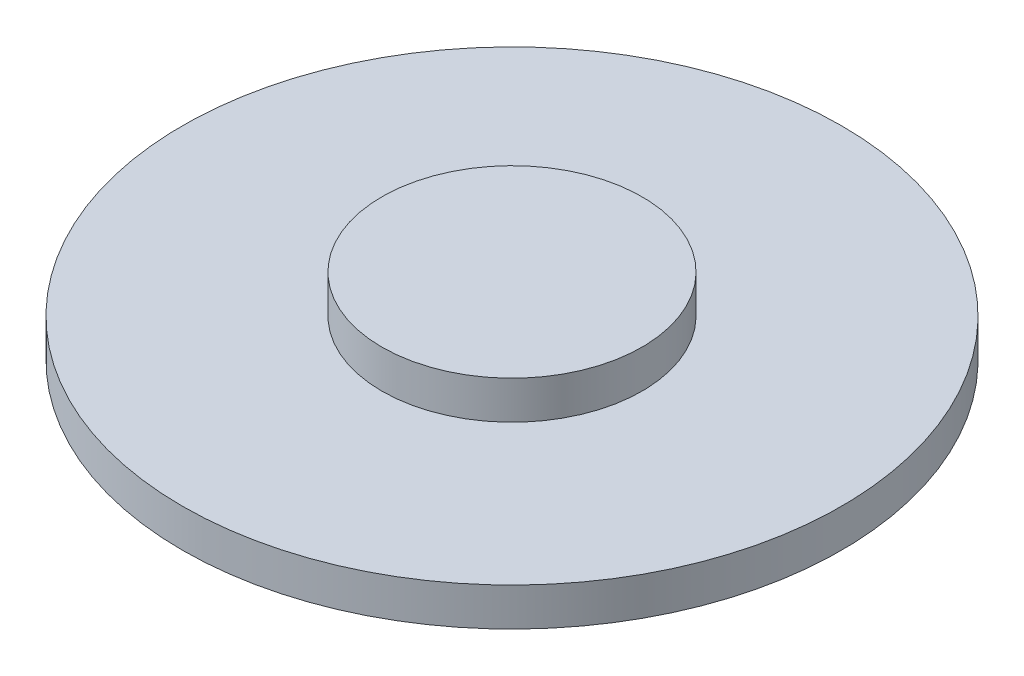
ISO-10303-21;
HEADER;
FILE_DESCRIPTION(('STEP AP214'),'2;1');
FILE_NAME('part.step','',(''),(''),'','','');
FILE_SCHEMA(('AUTOMOTIVE_DESIGN { 1 0 10303 214 1 1 1 1 }'));
ENDSEC;
DATA;
#1=APPLICATION_CONTEXT('core data for automotive mechanical design processes');
#2=APPLICATION_PROTOCOL_DEFINITION('international standard','automotive_design',2000,#1);
#3=PRODUCT_CONTEXT('',#1,'mechanical');
#4=PRODUCT('Part','Part','',(#3));
#5=PRODUCT_RELATED_PRODUCT_CATEGORY('part','',(#4));
#6=PRODUCT_DEFINITION_FORMATION('','',#4);
#7=PRODUCT_DEFINITION_CONTEXT('part definition',#1,'design');
#8=PRODUCT_DEFINITION('design','',#6,#7);
#9=PRODUCT_DEFINITION_SHAPE('','',#8);
#10=(LENGTH_UNIT() NAMED_UNIT(*) SI_UNIT(.MILLI.,.METRE.));
#11=(NAMED_UNIT(*) PLANE_ANGLE_UNIT() SI_UNIT($,.RADIAN.));
#12=(NAMED_UNIT(*) SI_UNIT($,.STERADIAN.) SOLID_ANGLE_UNIT());
#13=UNCERTAINTY_MEASURE_WITH_UNIT(LENGTH_MEASURE(1.E-05),#10,'distance_accuracy_value','');
#14=(GEOMETRIC_REPRESENTATION_CONTEXT(3) GLOBAL_UNCERTAINTY_ASSIGNED_CONTEXT((#13)) GLOBAL_UNIT_ASSIGNED_CONTEXT((#10,
#11,#12)) REPRESENTATION_CONTEXT('',''));
#15=CARTESIAN_POINT('',(0.,0.,0.));
#16=DIRECTION('',(0.,0.,1.));
#17=DIRECTION('',(1.,0.,0.));
#18=AXIS2_PLACEMENT_3D('',#15,#16,#17);
#19=CARTESIAN_POINT('',(0.,1.1684,0.));
#20=DIRECTION('',(0.,1.,0.));
#21=DIRECTION('',(0.,0.,1.));
#22=AXIS2_PLACEMENT_3D('',#19,#20,#21);
#23=PLANE('',#22);
#24=CARTESIAN_POINT('',(0.,1.1684,0.));
#25=DIRECTION('',(0.,1.,0.));
#26=DIRECTION('',(0.,0.,1.));
#27=AXIS2_PLACEMENT_3D('',#24,#25,#26);
#28=CIRCLE('',#27,10.0965);
#29=CARTESIAN_POINT('',(0.,1.1684,10.0965));
#30=VERTEX_POINT('',#29);
#31=EDGE_CURVE('E10',#30,#30,#28,.T.);
#32=ORIENTED_EDGE('',*,*,#31,.T.);
#33=EDGE_LOOP('',(#32));
#34=FACE_BOUND('',#33,.T.);
#35=CARTESIAN_POINT('',(0.,1.1684,0.));
#36=DIRECTION('',(0.,1.,0.));
#37=DIRECTION('',(0.,0.,1.));
#38=AXIS2_PLACEMENT_3D('',#35,#36,#37);
#39=CIRCLE('',#38,3.9878);
#40=CARTESIAN_POINT('',(0.,1.1684,3.9878));
#41=VERTEX_POINT('',#40);
#42=EDGE_CURVE('E46',#41,#41,#39,.T.);
#43=ORIENTED_EDGE('',*,*,#42,.F.);
#44=EDGE_LOOP('',(#43));
#45=FACE_BOUND('',#44,.T.);
#46=ADVANCED_FACE('F33',(#34,#45),#23,.T.);
#47=CARTESIAN_POINT('',(0.,1.1684,0.));
#48=DIRECTION('',(0.,-1.,0.));
#49=DIRECTION('',(0.,0.,-1.));
#50=AXIS2_PLACEMENT_3D('',#47,#48,#49);
#51=CYLINDRICAL_SURFACE('',#50,10.0965);
#52=ORIENTED_EDGE('',*,*,#31,.F.);
#53=EDGE_LOOP('',(#52));
#54=FACE_BOUND('',#53,.T.);
#55=CARTESIAN_POINT('',(0.,0.,0.));
#56=DIRECTION('',(0.,1.,0.));
#57=DIRECTION('',(0.,0.,1.));
#58=AXIS2_PLACEMENT_3D('',#55,#56,#57);
#59=CIRCLE('',#58,10.0965);
#60=CARTESIAN_POINT('',(0.,0.,10.0965));
#61=VERTEX_POINT('',#60);
#62=EDGE_CURVE('E37',#61,#61,#59,.T.);
#63=ORIENTED_EDGE('',*,*,#62,.T.);
#64=EDGE_LOOP('',(#63));
#65=FACE_BOUND('',#64,.T.);
#66=ADVANCED_FACE('F35',(#54,#65),#51,.T.);
#67=CARTESIAN_POINT('',(0.,0.,0.));
#68=DIRECTION('',(0.,1.,0.));
#69=DIRECTION('',(0.,0.,1.));
#70=AXIS2_PLACEMENT_3D('',#67,#68,#69);
#71=PLANE('',#70);
#72=ORIENTED_EDGE('',*,*,#62,.F.);
#73=EDGE_LOOP('',(#72));
#74=FACE_BOUND('',#73,.T.);
#75=ADVANCED_FACE('F57',(#74),#71,.F.);
#76=CARTESIAN_POINT('',(0.,2.3368,0.));
#77=DIRECTION('',(0.,-1.,0.));
#78=DIRECTION('',(0.,0.,-1.));
#79=AXIS2_PLACEMENT_3D('',#76,#77,#78);
#80=CYLINDRICAL_SURFACE('',#79,3.9878);
#81=CARTESIAN_POINT('',(0.,2.3368,0.));
#82=DIRECTION('',(0.,1.,0.));
#83=DIRECTION('',(0.,0.,1.));
#84=AXIS2_PLACEMENT_3D('',#81,#82,#83);
#85=CIRCLE('',#84,3.9878);
#86=CARTESIAN_POINT('',(0.,2.3368,3.9878));
#87=VERTEX_POINT('',#86);
#88=EDGE_CURVE('E44',#87,#87,#85,.T.);
#89=ORIENTED_EDGE('',*,*,#88,.F.);
#90=EDGE_LOOP('',(#89));
#91=FACE_BOUND('',#90,.T.);
#92=ORIENTED_EDGE('',*,*,#42,.T.);
#93=EDGE_LOOP('',(#92));
#94=FACE_BOUND('',#93,.T.);
#95=ADVANCED_FACE('F54',(#91,#94),#80,.T.);
#96=CARTESIAN_POINT('',(0.,2.3368,0.));
#97=DIRECTION('',(0.,1.,0.));
#98=DIRECTION('',(0.,0.,1.));
#99=AXIS2_PLACEMENT_3D('',#96,#97,#98);
#100=PLANE('',#99);
#101=ORIENTED_EDGE('',*,*,#88,.T.);
#102=EDGE_LOOP('',(#101));
#103=FACE_BOUND('',#102,.T.);
#104=ADVANCED_FACE('F52',(#103),#100,.T.);
#105=CLOSED_SHELL('',(#46,#66,#75,#95,#104));
#106=MANIFOLD_SOLID_BREP('B2',#105);
#107=ADVANCED_BREP_SHAPE_REPRESENTATION('',(#18,#106),#14);
#108=SHAPE_DEFINITION_REPRESENTATION(#9,#107);
ENDSEC;
END-ISO-10303-21;
